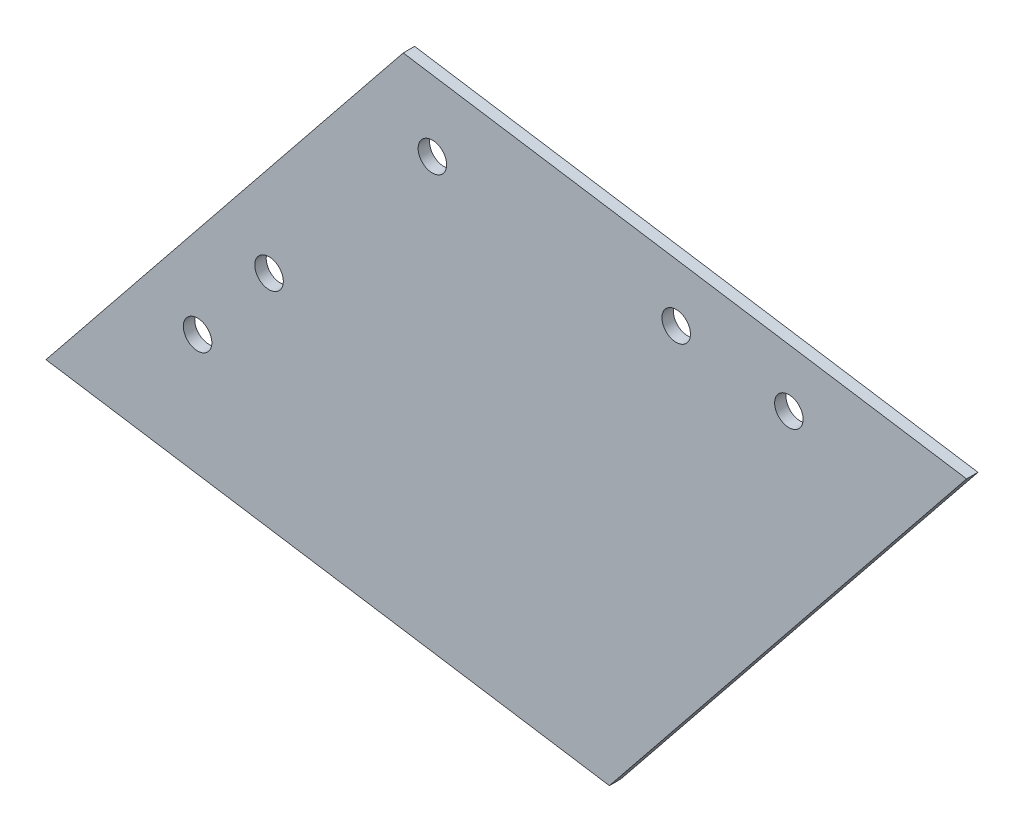
ISO-10303-21;
HEADER;
FILE_DESCRIPTION(('STEP AP214'),'2;1');
FILE_NAME('part.step','',(''),(''),'','','');
FILE_SCHEMA(('AUTOMOTIVE_DESIGN { 1 0 10303 214 1 1 1 1 }'));
ENDSEC;
DATA;
#1=APPLICATION_CONTEXT('core data for automotive mechanical design processes');
#2=APPLICATION_PROTOCOL_DEFINITION('international standard','automotive_design',2000,#1);
#3=PRODUCT_CONTEXT('',#1,'mechanical');
#4=PRODUCT('Part','Part','',(#3));
#5=PRODUCT_RELATED_PRODUCT_CATEGORY('part','',(#4));
#6=PRODUCT_DEFINITION_FORMATION('','',#4);
#7=PRODUCT_DEFINITION_CONTEXT('part definition',#1,'design');
#8=PRODUCT_DEFINITION('design','',#6,#7);
#9=PRODUCT_DEFINITION_SHAPE('','',#8);
#10=(LENGTH_UNIT() NAMED_UNIT(*) SI_UNIT(.MILLI.,.METRE.));
#11=(NAMED_UNIT(*) PLANE_ANGLE_UNIT() SI_UNIT($,.RADIAN.));
#12=(NAMED_UNIT(*) SI_UNIT($,.STERADIAN.) SOLID_ANGLE_UNIT());
#13=UNCERTAINTY_MEASURE_WITH_UNIT(LENGTH_MEASURE(1.E-05),#10,'distance_accuracy_value','');
#14=(GEOMETRIC_REPRESENTATION_CONTEXT(3) GLOBAL_UNCERTAINTY_ASSIGNED_CONTEXT((#13)) GLOBAL_UNIT_ASSIGNED_CONTEXT((#10,
#11,#12)) REPRESENTATION_CONTEXT('',''));
#15=CARTESIAN_POINT('',(0.,0.,0.));
#16=DIRECTION('',(0.,0.,1.));
#17=DIRECTION('',(1.,0.,0.));
#18=AXIS2_PLACEMENT_3D('',#15,#16,#17);
#19=CARTESIAN_POINT('',(0.,0.,2.));
#20=DIRECTION('',(0.153016209024444,0.988223679019982,0.));
#21=DIRECTION('',(-0.988223679019982,0.153016209024444,0.));
#22=AXIS2_PLACEMENT_3D('',#19,#20,#21);
#23=PLANE('',#22);
#24=DIRECTION('',(0.988223679019982,-0.153016209024444,0.));
#25=VECTOR('',#24,1.);
#26=CARTESIAN_POINT('',(0.,0.,0.));
#27=LINE('',#26,#25);
#28=CARTESIAN_POINT('',(0.,0.,0.));
#29=VERTEX_POINT('',#28);
#30=CARTESIAN_POINT('',(98.8223679019982,-15.3016209024444,0.));
#31=VERTEX_POINT('',#30);
#32=EDGE_CURVE('E97',#29,#31,#27,.T.);
#33=ORIENTED_EDGE('',*,*,#32,.T.);
#34=DIRECTION('',(0.,0.,-1.));
#35=VECTOR('',#34,1.);
#36=CARTESIAN_POINT('',(98.8223679019982,-15.3016209024444,2.));
#37=LINE('',#36,#35);
#38=CARTESIAN_POINT('',(98.8223679019982,-15.3016209024444,2.));
#39=VERTEX_POINT('',#38);
#40=EDGE_CURVE('E11',#39,#31,#37,.T.);
#41=ORIENTED_EDGE('',*,*,#40,.F.);
#42=DIRECTION('',(0.988223679019982,-0.153016209024444,0.));
#43=VECTOR('',#42,1.);
#44=CARTESIAN_POINT('',(0.,0.,2.));
#45=LINE('',#44,#43);
#46=CARTESIAN_POINT('',(0.,0.,2.));
#47=VERTEX_POINT('',#46);
#48=EDGE_CURVE('E85',#47,#39,#45,.T.);
#49=ORIENTED_EDGE('',*,*,#48,.F.);
#50=DIRECTION('',(0.,0.,-1.));
#51=VECTOR('',#50,1.);
#52=CARTESIAN_POINT('',(0.,0.,2.));
#53=LINE('',#52,#51);
#54=EDGE_CURVE('E93',#47,#29,#53,.T.);
#55=ORIENTED_EDGE('',*,*,#54,.T.);
#56=EDGE_LOOP('',(#33,#41,#49,#55));
#57=FACE_BOUND('',#56,.T.);
#58=ADVANCED_FACE('F34',(#57),#23,.F.);
#59=CARTESIAN_POINT('',(161.485144273593,62.6302497115959,2.));
#60=DIRECTION('',(-0.779318706140403,0.626627763715947,0.));
#61=DIRECTION('',(-0.626627763715947,-0.779318706140403,0.));
#62=AXIS2_PLACEMENT_3D('',#59,#60,#61);
#63=PLANE('',#62);
#64=DIRECTION('',(0.626627763715947,0.779318706140403,0.));
#65=VECTOR('',#64,1.);
#66=CARTESIAN_POINT('',(161.485144273593,62.6302497115959,0.));
#67=LINE('',#66,#65);
#68=CARTESIAN_POINT('',(161.485144273593,62.6302497115959,0.));
#69=VERTEX_POINT('',#68);
#70=EDGE_CURVE('E89',#31,#69,#67,.T.);
#71=ORIENTED_EDGE('',*,*,#70,.T.);
#72=DIRECTION('',(0.,0.,-1.));
#73=VECTOR('',#72,1.);
#74=CARTESIAN_POINT('',(161.485144273593,62.6302497115959,2.));
#75=LINE('',#74,#73);
#76=CARTESIAN_POINT('',(161.485144273593,62.6302497115959,2.));
#77=VERTEX_POINT('',#76);
#78=EDGE_CURVE('E42',#77,#69,#75,.T.);
#79=ORIENTED_EDGE('',*,*,#78,.F.);
#80=DIRECTION('',(0.626627763715947,0.779318706140403,0.));
#81=VECTOR('',#80,1.);
#82=CARTESIAN_POINT('',(161.485144273593,62.6302497115959,2.));
#83=LINE('',#82,#81);
#84=EDGE_CURVE('E80',#39,#77,#83,.T.);
#85=ORIENTED_EDGE('',*,*,#84,.F.);
#86=ORIENTED_EDGE('',*,*,#40,.T.);
#87=EDGE_LOOP('',(#71,#79,#85,#86));
#88=FACE_BOUND('',#87,.T.);
#89=ADVANCED_FACE('F88',(#88),#63,.F.);
#90=CARTESIAN_POINT('',(62.6627763715947,77.9318706140403,2.));
#91=DIRECTION('',(-0.153016209024444,-0.988223679019982,0.));
#92=DIRECTION('',(0.988223679019982,-0.153016209024444,0.));
#93=AXIS2_PLACEMENT_3D('',#90,#91,#92);
#94=PLANE('',#93);
#95=DIRECTION('',(-0.988223679019982,0.153016209024444,0.));
#96=VECTOR('',#95,1.);
#97=CARTESIAN_POINT('',(62.6627763715947,77.9318706140403,0.));
#98=LINE('',#97,#96);
#99=CARTESIAN_POINT('',(62.6627763715947,77.9318706140403,0.));
#100=VERTEX_POINT('',#99);
#101=EDGE_CURVE('E67',#69,#100,#98,.T.);
#102=ORIENTED_EDGE('',*,*,#101,.T.);
#103=DIRECTION('',(0.,0.,-1.));
#104=VECTOR('',#103,1.);
#105=CARTESIAN_POINT('',(62.6627763715947,77.9318706140403,2.));
#106=LINE('',#105,#104);
#107=CARTESIAN_POINT('',(62.6627763715947,77.9318706140403,2.));
#108=VERTEX_POINT('',#107);
#109=EDGE_CURVE('E90',#108,#100,#106,.T.);
#110=ORIENTED_EDGE('',*,*,#109,.F.);
#111=DIRECTION('',(-0.988223679019982,0.153016209024444,0.));
#112=VECTOR('',#111,1.);
#113=CARTESIAN_POINT('',(62.6627763715947,77.9318706140403,2.));
#114=LINE('',#113,#112);
#115=EDGE_CURVE('E83',#77,#108,#114,.T.);
#116=ORIENTED_EDGE('',*,*,#115,.F.);
#117=ORIENTED_EDGE('',*,*,#78,.T.);
#118=EDGE_LOOP('',(#102,#110,#116,#117));
#119=FACE_BOUND('',#118,.T.);
#120=ADVANCED_FACE('F91',(#119),#94,.F.);
#121=CARTESIAN_POINT('',(0.,0.,2.));
#122=DIRECTION('',(0.779318706140403,-0.626627763715947,0.));
#123=DIRECTION('',(0.626627763715947,0.779318706140403,0.));
#124=AXIS2_PLACEMENT_3D('',#121,#122,#123);
#125=PLANE('',#124);
#126=DIRECTION('',(-0.626627763715947,-0.779318706140403,0.));
#127=VECTOR('',#126,1.);
#128=CARTESIAN_POINT('',(0.,0.,0.));
#129=LINE('',#128,#127);
#130=EDGE_CURVE('E73',#100,#29,#129,.T.);
#131=ORIENTED_EDGE('',*,*,#130,.T.);
#132=ORIENTED_EDGE('',*,*,#54,.F.);
#133=DIRECTION('',(-0.626627763715947,-0.779318706140403,0.));
#134=VECTOR('',#133,1.);
#135=CARTESIAN_POINT('',(0.,0.,2.));
#136=LINE('',#135,#134);
#137=EDGE_CURVE('E50',#108,#47,#136,.T.);
#138=ORIENTED_EDGE('',*,*,#137,.F.);
#139=ORIENTED_EDGE('',*,*,#109,.T.);
#140=EDGE_LOOP('',(#131,#132,#138,#139));
#141=FACE_BOUND('',#140,.T.);
#142=ADVANCED_FACE('F105',(#141),#125,.F.);
#143=CARTESIAN_POINT('',(0.,0.,2.));
#144=DIRECTION('',(0.,0.,-1.));
#145=DIRECTION('',(-1.,0.,0.));
#146=AXIS2_PLACEMENT_3D('',#143,#144,#145);
#147=PLANE('',#146);
#148=CARTESIAN_POINT('',(67.7765148382305,64.7466638191646,2.));
#149=DIRECTION('',(0.,0.,-1.));
#150=DIRECTION('',(-1.,0.,0.));
#151=AXIS2_PLACEMENT_3D('',#148,#149,#150);
#152=CIRCLE('',#151,2.5);
#153=CARTESIAN_POINT('',(65.2765148382305,64.7466638191646,2.));
#154=VERTEX_POINT('',#153);
#155=EDGE_CURVE('E134',#154,#154,#152,.T.);
#156=ORIENTED_EDGE('',*,*,#155,.T.);
#157=EDGE_LOOP('',(#156));
#158=FACE_BOUND('',#157,.T.);
#159=CARTESIAN_POINT('',(110.543798232349,60.3988233726183,2.));
#160=DIRECTION('',(0.,0.,-1.));
#161=DIRECTION('',(-1.,0.,0.));
#162=AXIS2_PLACEMENT_3D('',#159,#160,#161);
#163=CIRCLE('',#162,2.50000000000001);
#164=CARTESIAN_POINT('',(108.043798232349,60.3988233726183,2.));
#165=VERTEX_POINT('',#164);
#166=EDGE_CURVE('E128',#165,#165,#163,.T.);
#167=ORIENTED_EDGE('',*,*,#166,.T.);
#168=EDGE_LOOP('',(#167));
#169=FACE_BOUND('',#168,.T.);
#170=CARTESIAN_POINT('',(130.308271812749,57.3384991921294,2.));
#171=DIRECTION('',(0.,0.,-1.));
#172=DIRECTION('',(-1.,0.,0.));
#173=AXIS2_PLACEMENT_3D('',#170,#171,#172);
#174=CIRCLE('',#173,2.5);
#175=CARTESIAN_POINT('',(127.808271812749,57.3384991921294,2.));
#176=VERTEX_POINT('',#175);
#177=EDGE_CURVE('E122',#176,#176,#174,.T.);
#178=ORIENTED_EDGE('',*,*,#177,.T.);
#179=EDGE_LOOP('',(#178));
#180=FACE_BOUND('',#179,.T.);
#181=CARTESIAN_POINT('',(26.5920199728824,17.1132835470526,2.));
#182=DIRECTION('',(0.,0.,-1.));
#183=DIRECTION('',(-1.,0.,0.));
#184=AXIS2_PLACEMENT_3D('',#181,#182,#183);
#185=CIRCLE('',#184,2.5);
#186=CARTESIAN_POINT('',(24.0920199728824,17.1132835470526,2.));
#187=VERTEX_POINT('',#186);
#188=EDGE_CURVE('E116',#187,#187,#185,.T.);
#189=ORIENTED_EDGE('',*,*,#188,.T.);
#190=EDGE_LOOP('',(#189));
#191=FACE_BOUND('',#190,.T.);
#192=CARTESIAN_POINT('',(39.1245752472014,32.6996576698607,2.));
#193=DIRECTION('',(0.,0.,-1.));
#194=DIRECTION('',(-1.,0.,0.));
#195=AXIS2_PLACEMENT_3D('',#192,#193,#194);
#196=CIRCLE('',#195,2.5);
#197=CARTESIAN_POINT('',(36.6245752472014,32.6996576698607,2.));
#198=VERTEX_POINT('',#197);
#199=EDGE_CURVE('E100',#198,#198,#196,.T.);
#200=ORIENTED_EDGE('',*,*,#199,.T.);
#201=EDGE_LOOP('',(#200));
#202=FACE_BOUND('',#201,.T.);
#203=ORIENTED_EDGE('',*,*,#48,.T.);
#204=ORIENTED_EDGE('',*,*,#84,.T.);
#205=ORIENTED_EDGE('',*,*,#115,.T.);
#206=ORIENTED_EDGE('',*,*,#137,.T.);
#207=EDGE_LOOP('',(#203,#204,#205,#206));
#208=FACE_BOUND('',#207,.T.);
#209=ADVANCED_FACE('F81',(#158,#169,#180,#191,#202,#208),#147,.F.);
#210=CARTESIAN_POINT('',(0.,0.,0.));
#211=DIRECTION('',(0.,0.,-1.));
#212=DIRECTION('',(-1.,0.,0.));
#213=AXIS2_PLACEMENT_3D('',#210,#211,#212);
#214=PLANE('',#213);
#215=CARTESIAN_POINT('',(67.7765148382305,64.7466638191646,0.));
#216=DIRECTION('',(0.,0.,-1.));
#217=DIRECTION('',(-1.,0.,0.));
#218=AXIS2_PLACEMENT_3D('',#215,#216,#217);
#219=CIRCLE('',#218,2.5);
#220=CARTESIAN_POINT('',(65.2765148382305,64.7466638191646,0.));
#221=VERTEX_POINT('',#220);
#222=EDGE_CURVE('E137',#221,#221,#219,.T.);
#223=ORIENTED_EDGE('',*,*,#222,.F.);
#224=EDGE_LOOP('',(#223));
#225=FACE_BOUND('',#224,.T.);
#226=CARTESIAN_POINT('',(110.543798232349,60.3988233726183,0.));
#227=DIRECTION('',(0.,0.,-1.));
#228=DIRECTION('',(-1.,0.,0.));
#229=AXIS2_PLACEMENT_3D('',#226,#227,#228);
#230=CIRCLE('',#229,2.50000000000001);
#231=CARTESIAN_POINT('',(108.043798232349,60.3988233726183,0.));
#232=VERTEX_POINT('',#231);
#233=EDGE_CURVE('E131',#232,#232,#230,.T.);
#234=ORIENTED_EDGE('',*,*,#233,.F.);
#235=EDGE_LOOP('',(#234));
#236=FACE_BOUND('',#235,.T.);
#237=CARTESIAN_POINT('',(130.308271812749,57.3384991921294,0.));
#238=DIRECTION('',(0.,0.,-1.));
#239=DIRECTION('',(-1.,0.,0.));
#240=AXIS2_PLACEMENT_3D('',#237,#238,#239);
#241=CIRCLE('',#240,2.5);
#242=CARTESIAN_POINT('',(127.808271812749,57.3384991921294,0.));
#243=VERTEX_POINT('',#242);
#244=EDGE_CURVE('E125',#243,#243,#241,.T.);
#245=ORIENTED_EDGE('',*,*,#244,.F.);
#246=EDGE_LOOP('',(#245));
#247=FACE_BOUND('',#246,.T.);
#248=CARTESIAN_POINT('',(26.5920199728824,17.1132835470526,0.));
#249=DIRECTION('',(0.,0.,-1.));
#250=DIRECTION('',(-1.,0.,0.));
#251=AXIS2_PLACEMENT_3D('',#248,#249,#250);
#252=CIRCLE('',#251,2.5);
#253=CARTESIAN_POINT('',(24.0920199728824,17.1132835470526,0.));
#254=VERTEX_POINT('',#253);
#255=EDGE_CURVE('E119',#254,#254,#252,.T.);
#256=ORIENTED_EDGE('',*,*,#255,.F.);
#257=EDGE_LOOP('',(#256));
#258=FACE_BOUND('',#257,.T.);
#259=CARTESIAN_POINT('',(39.1245752472014,32.6996576698607,0.));
#260=DIRECTION('',(0.,0.,-1.));
#261=DIRECTION('',(-1.,0.,0.));
#262=AXIS2_PLACEMENT_3D('',#259,#260,#261);
#263=CIRCLE('',#262,2.5);
#264=CARTESIAN_POINT('',(36.6245752472014,32.6996576698607,0.));
#265=VERTEX_POINT('',#264);
#266=EDGE_CURVE('E113',#265,#265,#263,.T.);
#267=ORIENTED_EDGE('',*,*,#266,.F.);
#268=EDGE_LOOP('',(#267));
#269=FACE_BOUND('',#268,.T.);
#270=ORIENTED_EDGE('',*,*,#32,.F.);
#271=ORIENTED_EDGE('',*,*,#130,.F.);
#272=ORIENTED_EDGE('',*,*,#101,.F.);
#273=ORIENTED_EDGE('',*,*,#70,.F.);
#274=EDGE_LOOP('',(#270,#271,#272,#273));
#275=FACE_BOUND('',#274,.T.);
#276=ADVANCED_FACE('F108',(#225,#236,#247,#258,#269,#275),#214,.T.);
#277=CARTESIAN_POINT('',(39.1245752472014,32.6996576698607,6.));
#278=DIRECTION('',(0.,0.,-1.));
#279=DIRECTION('',(-1.,0.,0.));
#280=AXIS2_PLACEMENT_3D('',#277,#278,#279);
#281=CYLINDRICAL_SURFACE('',#280,2.5);
#282=ORIENTED_EDGE('',*,*,#266,.T.);
#283=EDGE_LOOP('',(#282));
#284=FACE_BOUND('',#283,.T.);
#285=ORIENTED_EDGE('',*,*,#199,.F.);
#286=EDGE_LOOP('',(#285));
#287=FACE_BOUND('',#286,.T.);
#288=ADVANCED_FACE('F146',(#284,#287),#281,.F.);
#289=CARTESIAN_POINT('',(26.5920199728824,17.1132835470526,6.));
#290=DIRECTION('',(0.,0.,-1.));
#291=DIRECTION('',(-1.,0.,0.));
#292=AXIS2_PLACEMENT_3D('',#289,#290,#291);
#293=CYLINDRICAL_SURFACE('',#292,2.5);
#294=ORIENTED_EDGE('',*,*,#255,.T.);
#295=EDGE_LOOP('',(#294));
#296=FACE_BOUND('',#295,.T.);
#297=ORIENTED_EDGE('',*,*,#188,.F.);
#298=EDGE_LOOP('',(#297));
#299=FACE_BOUND('',#298,.T.);
#300=ADVANCED_FACE('F158',(#296,#299),#293,.F.);
#301=CARTESIAN_POINT('',(130.308271812749,57.3384991921294,6.));
#302=DIRECTION('',(0.,0.,-1.));
#303=DIRECTION('',(-1.,0.,0.));
#304=AXIS2_PLACEMENT_3D('',#301,#302,#303);
#305=CYLINDRICAL_SURFACE('',#304,2.5);
#306=ORIENTED_EDGE('',*,*,#244,.T.);
#307=EDGE_LOOP('',(#306));
#308=FACE_BOUND('',#307,.T.);
#309=ORIENTED_EDGE('',*,*,#177,.F.);
#310=EDGE_LOOP('',(#309));
#311=FACE_BOUND('',#310,.T.);
#312=ADVANCED_FACE('F201',(#308,#311),#305,.F.);
#313=CARTESIAN_POINT('',(110.543798232349,60.3988233726183,6.));
#314=DIRECTION('',(0.,0.,-1.));
#315=DIRECTION('',(-1.,0.,0.));
#316=AXIS2_PLACEMENT_3D('',#313,#314,#315);
#317=CYLINDRICAL_SURFACE('',#316,2.50000000000001);
#318=ORIENTED_EDGE('',*,*,#233,.T.);
#319=EDGE_LOOP('',(#318));
#320=FACE_BOUND('',#319,.T.);
#321=ORIENTED_EDGE('',*,*,#166,.F.);
#322=EDGE_LOOP('',(#321));
#323=FACE_BOUND('',#322,.T.);
#324=ADVANCED_FACE('F211',(#320,#323),#317,.F.);
#325=CARTESIAN_POINT('',(67.7765148382305,64.7466638191646,6.));
#326=DIRECTION('',(0.,0.,-1.));
#327=DIRECTION('',(-1.,0.,0.));
#328=AXIS2_PLACEMENT_3D('',#325,#326,#327);
#329=CYLINDRICAL_SURFACE('',#328,2.5);
#330=ORIENTED_EDGE('',*,*,#222,.T.);
#331=EDGE_LOOP('',(#330));
#332=FACE_BOUND('',#331,.T.);
#333=ORIENTED_EDGE('',*,*,#155,.F.);
#334=EDGE_LOOP('',(#333));
#335=FACE_BOUND('',#334,.T.);
#336=ADVANCED_FACE('F141',(#332,#335),#329,.F.);
#337=CLOSED_SHELL('',(#58,#89,#120,#142,#209,#276,#288,#300,#312,#324,#336));
#338=MANIFOLD_SOLID_BREP('B2',#337);
#339=ADVANCED_BREP_SHAPE_REPRESENTATION('',(#18,#338),#14);
#340=SHAPE_DEFINITION_REPRESENTATION(#9,#339);
ENDSEC;
END-ISO-10303-21;
